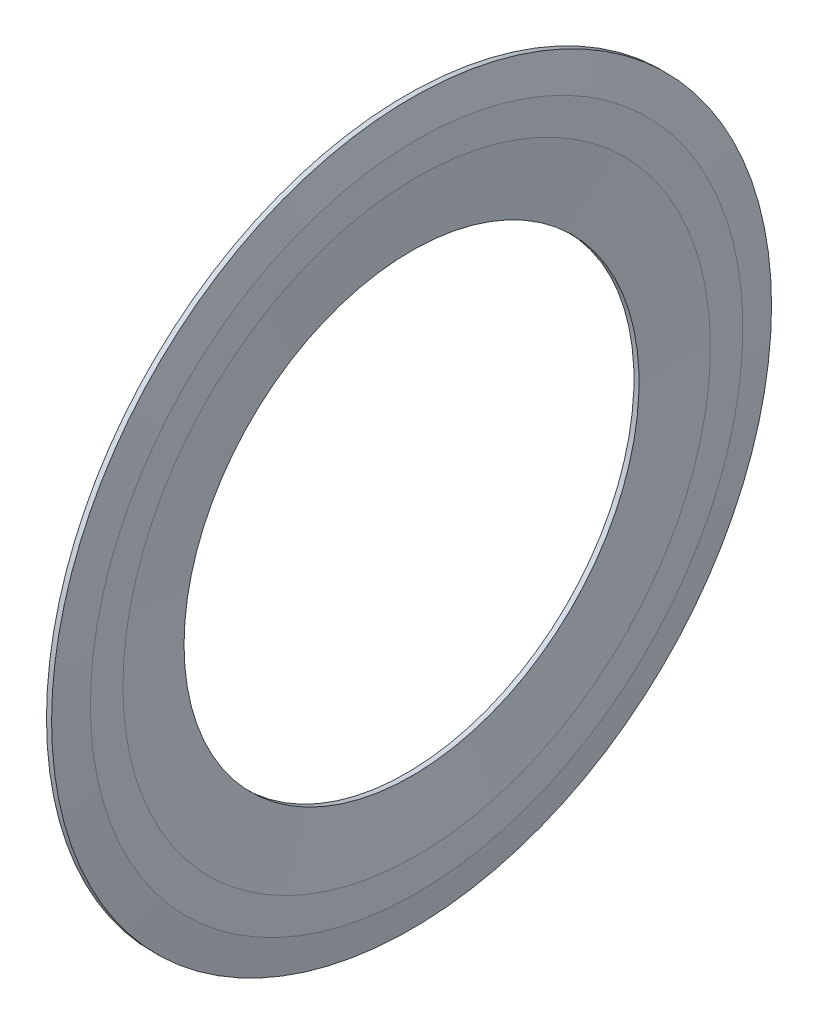
ISO-10303-21;
HEADER;
FILE_DESCRIPTION(('STEP AP214'),'2;1');
FILE_NAME('part.step','',(''),(''),'','','');
FILE_SCHEMA(('AUTOMOTIVE_DESIGN { 1 0 10303 214 1 1 1 1 }'));
ENDSEC;
DATA;
#1=APPLICATION_CONTEXT('core data for automotive mechanical design processes');
#2=APPLICATION_PROTOCOL_DEFINITION('international standard','automotive_design',2000,#1);
#3=PRODUCT_CONTEXT('',#1,'mechanical');
#4=PRODUCT('Part','Part','',(#3));
#5=PRODUCT_RELATED_PRODUCT_CATEGORY('part','',(#4));
#6=PRODUCT_DEFINITION_FORMATION('','',#4);
#7=PRODUCT_DEFINITION_CONTEXT('part definition',#1,'design');
#8=PRODUCT_DEFINITION('design','',#6,#7);
#9=PRODUCT_DEFINITION_SHAPE('','',#8);
#10=(LENGTH_UNIT() NAMED_UNIT(*) SI_UNIT(.MILLI.,.METRE.));
#11=(NAMED_UNIT(*) PLANE_ANGLE_UNIT() SI_UNIT($,.RADIAN.));
#12=(NAMED_UNIT(*) SI_UNIT($,.STERADIAN.) SOLID_ANGLE_UNIT());
#13=UNCERTAINTY_MEASURE_WITH_UNIT(LENGTH_MEASURE(1.E-05),#10,'distance_accuracy_value','');
#14=(GEOMETRIC_REPRESENTATION_CONTEXT(3) GLOBAL_UNCERTAINTY_ASSIGNED_CONTEXT((#13)) GLOBAL_UNIT_ASSIGNED_CONTEXT((#10,
#11,#12)) REPRESENTATION_CONTEXT('',''));
#15=CARTESIAN_POINT('',(0.,0.,0.));
#16=DIRECTION('',(0.,0.,1.));
#17=DIRECTION('',(1.,0.,0.));
#18=AXIS2_PLACEMENT_3D('',#15,#16,#17);
#19=CARTESIAN_POINT('',(0.53,10.2,0.));
#20=DIRECTION('',(1.,0.,0.));
#21=DIRECTION('',(0.,0.,-1.));
#22=AXIS2_PLACEMENT_3D('',#19,#20,#21);
#23=PLANE('',#22);
#24=CARTESIAN_POINT('',(0.53,0.,0.));
#25=DIRECTION('',(-1.,0.,0.));
#26=DIRECTION('',(0.,0.,1.));
#27=AXIS2_PLACEMENT_3D('',#24,#25,#26);
#28=CIRCLE('',#27,7.9);
#29=CARTESIAN_POINT('',(0.53,0.,7.9));
#30=VERTEX_POINT('',#29);
#31=EDGE_CURVE('E10',#30,#30,#28,.T.);
#32=ORIENTED_EDGE('',*,*,#31,.F.);
#33=EDGE_LOOP('',(#32));
#34=FACE_BOUND('',#33,.T.);
#35=CARTESIAN_POINT('',(0.53,0.,0.));
#36=DIRECTION('',(-1.,0.,0.));
#37=DIRECTION('',(0.,0.,1.));
#38=AXIS2_PLACEMENT_3D('',#35,#36,#37);
#39=CIRCLE('',#38,10.2);
#40=CARTESIAN_POINT('',(0.53,0.,10.2));
#41=VERTEX_POINT('',#40);
#42=EDGE_CURVE('E57',#41,#41,#39,.T.);
#43=ORIENTED_EDGE('',*,*,#42,.T.);
#44=EDGE_LOOP('',(#43));
#45=FACE_BOUND('',#44,.T.);
#46=ADVANCED_FACE('F29',(#34,#45),#23,.F.);
#47=CARTESIAN_POINT('',(0.707,0.,0.));
#48=DIRECTION('',(-1.,0.,0.));
#49=DIRECTION('',(0.,0.,1.));
#50=AXIS2_PLACEMENT_3D('',#47,#48,#49);
#51=CYLINDRICAL_SURFACE('',#50,7.9);
#52=CARTESIAN_POINT('',(0.707,0.,0.));
#53=DIRECTION('',(-1.,0.,0.));
#54=DIRECTION('',(0.,0.,1.));
#55=AXIS2_PLACEMENT_3D('',#52,#53,#54);
#56=CIRCLE('',#55,7.9);
#57=CARTESIAN_POINT('',(0.707,0.,7.9));
#58=VERTEX_POINT('',#57);
#59=EDGE_CURVE('E35',#58,#58,#56,.T.);
#60=ORIENTED_EDGE('',*,*,#59,.F.);
#61=EDGE_LOOP('',(#60));
#62=FACE_BOUND('',#61,.T.);
#63=ORIENTED_EDGE('',*,*,#31,.T.);
#64=EDGE_LOOP('',(#63));
#65=FACE_BOUND('',#64,.T.);
#66=ADVANCED_FACE('F94',(#62,#65),#51,.F.);
#67=CARTESIAN_POINT('',(0.707,0.,0.));
#68=DIRECTION('',(1.,0.,0.));
#69=DIRECTION('',(0.,0.,-1.));
#70=AXIS2_PLACEMENT_3D('',#67,#68,#69);
#71=CONICAL_SURFACE('',#70,7.9,1.49399118752832);
#72=CARTESIAN_POINT('',(0.884,0.,0.));
#73=DIRECTION('',(-1.,0.,0.));
#74=DIRECTION('',(0.,0.,1.));
#75=AXIS2_PLACEMENT_3D('',#72,#73,#74);
#76=CIRCLE('',#75,10.2);
#77=CARTESIAN_POINT('',(0.884,0.,10.2));
#78=VERTEX_POINT('',#77);
#79=EDGE_CURVE('E39',#78,#78,#76,.T.);
#80=ORIENTED_EDGE('',*,*,#79,.F.);
#81=EDGE_LOOP('',(#80));
#82=FACE_BOUND('',#81,.T.);
#83=ORIENTED_EDGE('',*,*,#59,.T.);
#84=EDGE_LOOP('',(#83));
#85=FACE_BOUND('',#84,.T.);
#86=ADVANCED_FACE('F89',(#82,#85),#71,.F.);
#87=CARTESIAN_POINT('',(0.884,10.2,0.));
#88=DIRECTION('',(-1.,0.,0.));
#89=DIRECTION('',(0.,0.,1.));
#90=AXIS2_PLACEMENT_3D('',#87,#88,#89);
#91=PLANE('',#90);
#92=CARTESIAN_POINT('',(0.884,0.,0.));
#93=DIRECTION('',(-1.,0.,0.));
#94=DIRECTION('',(0.,0.,1.));
#95=AXIS2_PLACEMENT_3D('',#92,#93,#94);
#96=CIRCLE('',#95,11.329568043478);
#97=CARTESIAN_POINT('',(0.884,0.,11.329568043478));
#98=VERTEX_POINT('',#97);
#99=EDGE_CURVE('E43',#98,#98,#96,.T.);
#100=ORIENTED_EDGE('',*,*,#99,.F.);
#101=EDGE_LOOP('',(#100));
#102=FACE_BOUND('',#101,.T.);
#103=ORIENTED_EDGE('',*,*,#79,.T.);
#104=EDGE_LOOP('',(#103));
#105=FACE_BOUND('',#104,.T.);
#106=ADVANCED_FACE('F83',(#102,#105),#91,.F.);
#107=CARTESIAN_POINT('',(0.884,0.,0.));
#108=DIRECTION('',(-1.,0.,0.));
#109=DIRECTION('',(0.,0.,1.));
#110=AXIS2_PLACEMENT_3D('',#107,#108,#109);
#111=CONICAL_SURFACE('',#110,11.329568043478,1.42070735874394);
#112=CARTESIAN_POINT('',(0.707,0.,0.));
#113=DIRECTION('',(-1.,0.,0.));
#114=DIRECTION('',(0.,0.,1.));
#115=AXIS2_PLACEMENT_3D('',#112,#113,#114);
#116=CIRCLE('',#115,12.5);
#117=CARTESIAN_POINT('',(0.707,0.,12.5));
#118=VERTEX_POINT('',#117);
#119=EDGE_CURVE('E48',#118,#118,#116,.T.);
#120=ORIENTED_EDGE('',*,*,#119,.F.);
#121=EDGE_LOOP('',(#120));
#122=FACE_BOUND('',#121,.T.);
#123=ORIENTED_EDGE('',*,*,#99,.T.);
#124=EDGE_LOOP('',(#123));
#125=FACE_BOUND('',#124,.T.);
#126=ADVANCED_FACE('F77',(#122,#125),#111,.T.);
#127=CARTESIAN_POINT('',(0.707,0.,0.));
#128=DIRECTION('',(-1.,0.,0.));
#129=DIRECTION('',(0.,0.,1.));
#130=AXIS2_PLACEMENT_3D('',#127,#128,#129);
#131=CYLINDRICAL_SURFACE('',#130,12.5);
#132=CARTESIAN_POINT('',(0.53,0.,0.));
#133=DIRECTION('',(-1.,0.,0.));
#134=DIRECTION('',(0.,0.,1.));
#135=AXIS2_PLACEMENT_3D('',#132,#133,#134);
#136=CIRCLE('',#135,12.5);
#137=CARTESIAN_POINT('',(0.53,0.,12.5));
#138=VERTEX_POINT('',#137);
#139=EDGE_CURVE('E51',#138,#138,#136,.T.);
#140=ORIENTED_EDGE('',*,*,#139,.F.);
#141=EDGE_LOOP('',(#140));
#142=FACE_BOUND('',#141,.T.);
#143=ORIENTED_EDGE('',*,*,#119,.T.);
#144=EDGE_LOOP('',(#143));
#145=FACE_BOUND('',#144,.T.);
#146=ADVANCED_FACE('F71',(#142,#145),#131,.T.);
#147=CARTESIAN_POINT('',(0.53,0.,0.));
#148=DIRECTION('',(-1.,0.,0.));
#149=DIRECTION('',(0.,0.,1.));
#150=AXIS2_PLACEMENT_3D('',#147,#148,#149);
#151=CONICAL_SURFACE('',#150,12.5,1.49399118752832);
#152=CARTESIAN_POINT('',(0.6185,0.,0.));
#153=DIRECTION('',(-1.,0.,0.));
#154=DIRECTION('',(0.,0.,1.));
#155=AXIS2_PLACEMENT_3D('',#152,#153,#154);
#156=CIRCLE('',#155,11.35);
#157=CARTESIAN_POINT('',(0.6185,0.,11.35));
#158=VERTEX_POINT('',#157);
#159=EDGE_CURVE('E54',#158,#158,#156,.T.);
#160=ORIENTED_EDGE('',*,*,#159,.F.);
#161=EDGE_LOOP('',(#160));
#162=FACE_BOUND('',#161,.T.);
#163=ORIENTED_EDGE('',*,*,#139,.T.);
#164=EDGE_LOOP('',(#163));
#165=FACE_BOUND('',#164,.T.);
#166=ADVANCED_FACE('F65',(#162,#165),#151,.F.);
#167=CARTESIAN_POINT('',(0.6185,0.,0.));
#168=DIRECTION('',(1.,0.,0.));
#169=DIRECTION('',(0.,0.,-1.));
#170=AXIS2_PLACEMENT_3D('',#167,#168,#169);
#171=CONICAL_SURFACE('',#170,11.35,1.49399118752832);
#172=ORIENTED_EDGE('',*,*,#42,.F.);
#173=EDGE_LOOP('',(#172));
#174=FACE_BOUND('',#173,.T.);
#175=ORIENTED_EDGE('',*,*,#159,.T.);
#176=EDGE_LOOP('',(#175));
#177=FACE_BOUND('',#176,.T.);
#178=ADVANCED_FACE('F62',(#174,#177),#171,.T.);
#179=CLOSED_SHELL('',(#46,#66,#86,#106,#126,#146,#166,#178));
#180=MANIFOLD_SOLID_BREP('B2',#179);
#181=ADVANCED_BREP_SHAPE_REPRESENTATION('',(#18,#180),#14);
#182=SHAPE_DEFINITION_REPRESENTATION(#9,#181);
ENDSEC;
END-ISO-10303-21;
